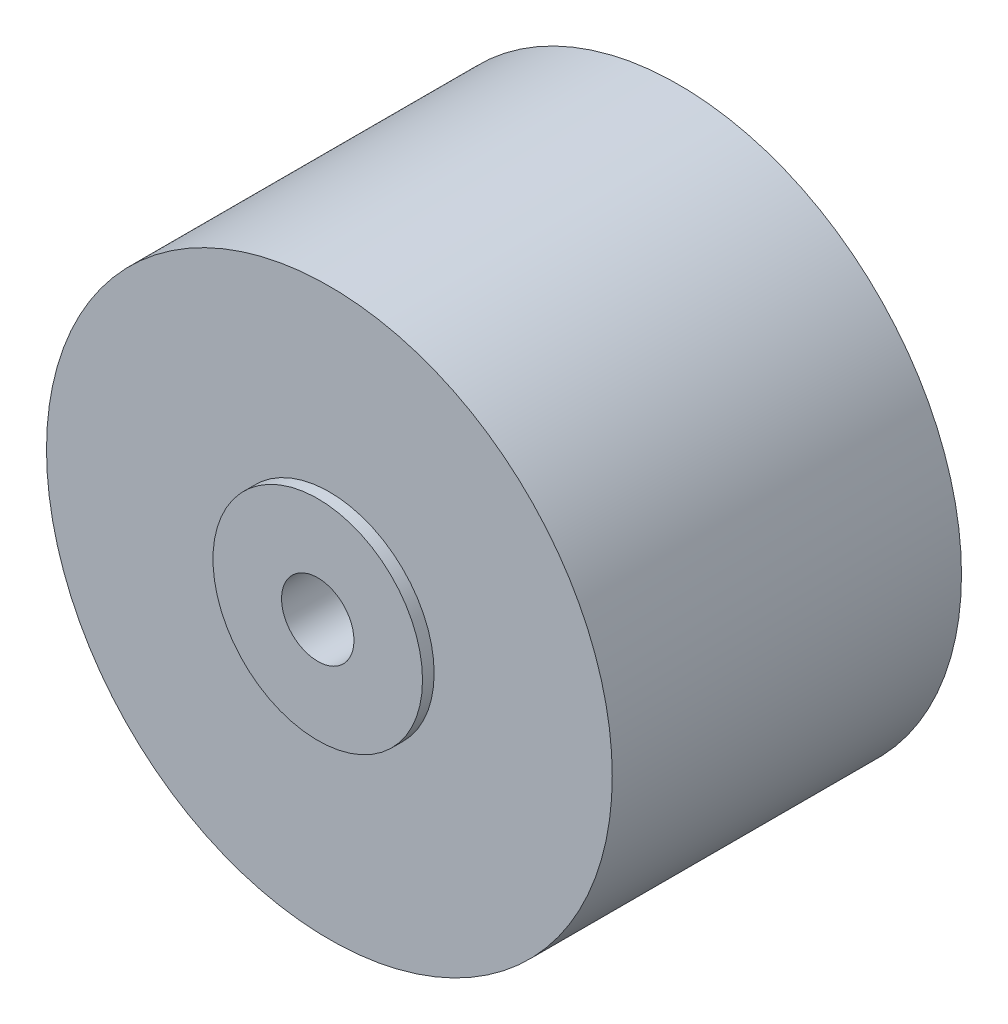
ISO-10303-21;
HEADER;
FILE_DESCRIPTION(('STEP AP214'),'2;1');
FILE_NAME('part.step','',(''),(''),'','','');
FILE_SCHEMA(('AUTOMOTIVE_DESIGN { 1 0 10303 214 1 1 1 1 }'));
ENDSEC;
DATA;
#1=APPLICATION_CONTEXT('core data for automotive mechanical design processes');
#2=APPLICATION_PROTOCOL_DEFINITION('international standard','automotive_design',2000,#1);
#3=PRODUCT_CONTEXT('',#1,'mechanical');
#4=PRODUCT('Part','Part','',(#3));
#5=PRODUCT_RELATED_PRODUCT_CATEGORY('part','',(#4));
#6=PRODUCT_DEFINITION_FORMATION('','',#4);
#7=PRODUCT_DEFINITION_CONTEXT('part definition',#1,'design');
#8=PRODUCT_DEFINITION('design','',#6,#7);
#9=PRODUCT_DEFINITION_SHAPE('','',#8);
#10=(LENGTH_UNIT() NAMED_UNIT(*) SI_UNIT(.MILLI.,.METRE.));
#11=(NAMED_UNIT(*) PLANE_ANGLE_UNIT() SI_UNIT($,.RADIAN.));
#12=(NAMED_UNIT(*) SI_UNIT($,.STERADIAN.) SOLID_ANGLE_UNIT());
#13=UNCERTAINTY_MEASURE_WITH_UNIT(LENGTH_MEASURE(1.E-05),#10,'distance_accuracy_value','');
#14=(GEOMETRIC_REPRESENTATION_CONTEXT(3) GLOBAL_UNCERTAINTY_ASSIGNED_CONTEXT((#13)) GLOBAL_UNIT_ASSIGNED_CONTEXT((#10,
#11,#12)) REPRESENTATION_CONTEXT('',''));
#15=CARTESIAN_POINT('',(0.,0.,0.));
#16=DIRECTION('',(0.,0.,1.));
#17=DIRECTION('',(1.,0.,0.));
#18=AXIS2_PLACEMENT_3D('',#15,#16,#17);
#19=CARTESIAN_POINT('',(0.,0.,0.));
#20=DIRECTION('',(0.,0.,1.));
#21=DIRECTION('',(1.,0.,0.));
#22=AXIS2_PLACEMENT_3D('',#19,#20,#21);
#23=PLANE('',#22);
#24=CARTESIAN_POINT('',(0.,0.,0.));
#25=DIRECTION('',(0.,0.,1.));
#26=DIRECTION('',(1.,0.,0.));
#27=AXIS2_PLACEMENT_3D('',#24,#25,#26);
#28=CIRCLE('',#27,12.15);
#29=CARTESIAN_POINT('',(12.15,0.,0.));
#30=VERTEX_POINT('',#29);
#31=EDGE_CURVE('E39',#30,#30,#28,.T.);
#32=ORIENTED_EDGE('',*,*,#31,.F.);
#33=EDGE_LOOP('',(#32));
#34=FACE_BOUND('',#33,.T.);
#35=CARTESIAN_POINT('',(0.,0.,0.));
#36=DIRECTION('',(0.,0.,1.));
#37=DIRECTION('',(1.,0.,0.));
#38=AXIS2_PLACEMENT_3D('',#35,#36,#37);
#39=CIRCLE('',#38,1.5549846660581);
#40=CARTESIAN_POINT('',(1.5549846660581,0.,0.));
#41=VERTEX_POINT('',#40);
#42=EDGE_CURVE('E51',#41,#41,#39,.F.);
#43=ORIENTED_EDGE('',*,*,#42,.F.);
#44=EDGE_LOOP('',(#43));
#45=FACE_BOUND('',#44,.T.);
#46=ADVANCED_FACE('F31',(#34,#45),#23,.F.);
#47=CARTESIAN_POINT('',(0.,0.,15.5));
#48=DIRECTION('',(0.,0.,1.));
#49=DIRECTION('',(1.,0.,0.));
#50=AXIS2_PLACEMENT_3D('',#47,#48,#49);
#51=PLANE('',#50);
#52=CARTESIAN_POINT('',(0.,0.,15.5));
#53=DIRECTION('',(0.,0.,1.));
#54=DIRECTION('',(1.,0.,0.));
#55=AXIS2_PLACEMENT_3D('',#52,#53,#54);
#56=CIRCLE('',#55,4.5);
#57=CARTESIAN_POINT('',(4.5,0.,15.5));
#58=VERTEX_POINT('',#57);
#59=EDGE_CURVE('E48',#58,#58,#56,.T.);
#60=ORIENTED_EDGE('',*,*,#59,.T.);
#61=EDGE_LOOP('',(#60));
#62=FACE_BOUND('',#61,.T.);
#63=CARTESIAN_POINT('',(0.,0.,15.5));
#64=DIRECTION('',(0.,0.,1.));
#65=DIRECTION('',(1.,0.,0.));
#66=AXIS2_PLACEMENT_3D('',#63,#64,#65);
#67=CIRCLE('',#66,1.5549846660581);
#68=CARTESIAN_POINT('',(1.5549846660581,0.,15.5));
#69=VERTEX_POINT('',#68);
#70=EDGE_CURVE('E35',#69,#69,#67,.F.);
#71=ORIENTED_EDGE('',*,*,#70,.T.);
#72=EDGE_LOOP('',(#71));
#73=FACE_BOUND('',#72,.T.);
#74=ADVANCED_FACE('F58',(#62,#73),#51,.T.);
#75=CARTESIAN_POINT('',(0.,0.,15.));
#76=DIRECTION('',(0.,0.,1.));
#77=DIRECTION('',(1.,0.,0.));
#78=AXIS2_PLACEMENT_3D('',#75,#76,#77);
#79=PLANE('',#78);
#80=CARTESIAN_POINT('',(0.,0.,15.));
#81=DIRECTION('',(0.,0.,1.));
#82=DIRECTION('',(1.,0.,0.));
#83=AXIS2_PLACEMENT_3D('',#80,#81,#82);
#84=CIRCLE('',#83,12.15);
#85=CARTESIAN_POINT('',(12.15,0.,15.));
#86=VERTEX_POINT('',#85);
#87=EDGE_CURVE('E10',#86,#86,#84,.T.);
#88=ORIENTED_EDGE('',*,*,#87,.T.);
#89=EDGE_LOOP('',(#88));
#90=FACE_BOUND('',#89,.T.);
#91=CARTESIAN_POINT('',(0.,0.,15.));
#92=DIRECTION('',(0.,0.,1.));
#93=DIRECTION('',(1.,0.,0.));
#94=AXIS2_PLACEMENT_3D('',#91,#92,#93);
#95=CIRCLE('',#94,4.5);
#96=CARTESIAN_POINT('',(4.5,0.,15.));
#97=VERTEX_POINT('',#96);
#98=EDGE_CURVE('E44',#97,#97,#95,.F.);
#99=ORIENTED_EDGE('',*,*,#98,.T.);
#100=EDGE_LOOP('',(#99));
#101=FACE_BOUND('',#100,.T.);
#102=ADVANCED_FACE('F75',(#90,#101),#79,.T.);
#103=CARTESIAN_POINT('',(0.,0.,15.));
#104=DIRECTION('',(0.,0.,-1.));
#105=DIRECTION('',(-1.,0.,0.));
#106=AXIS2_PLACEMENT_3D('',#103,#104,#105);
#107=CYLINDRICAL_SURFACE('',#106,12.15);
#108=ORIENTED_EDGE('',*,*,#87,.F.);
#109=EDGE_LOOP('',(#108));
#110=FACE_BOUND('',#109,.T.);
#111=ORIENTED_EDGE('',*,*,#31,.T.);
#112=EDGE_LOOP('',(#111));
#113=FACE_BOUND('',#112,.T.);
#114=ADVANCED_FACE('F33',(#110,#113),#107,.T.);
#115=CARTESIAN_POINT('',(0.,0.,15.5));
#116=DIRECTION('',(0.,0.,-1.));
#117=DIRECTION('',(-1.,0.,0.));
#118=AXIS2_PLACEMENT_3D('',#115,#116,#117);
#119=CYLINDRICAL_SURFACE('',#118,4.5);
#120=ORIENTED_EDGE('',*,*,#98,.F.);
#121=EDGE_LOOP('',(#120));
#122=FACE_BOUND('',#121,.T.);
#123=ORIENTED_EDGE('',*,*,#59,.F.);
#124=EDGE_LOOP('',(#123));
#125=FACE_BOUND('',#124,.T.);
#126=ADVANCED_FACE('F62',(#122,#125),#119,.T.);
#127=CARTESIAN_POINT('',(0.,0.,19.5));
#128=DIRECTION('',(0.,0.,-1.));
#129=DIRECTION('',(-1.,0.,0.));
#130=AXIS2_PLACEMENT_3D('',#127,#128,#129);
#131=CYLINDRICAL_SURFACE('',#130,1.5549846660581);
#132=ORIENTED_EDGE('',*,*,#70,.F.);
#133=EDGE_LOOP('',(#132));
#134=FACE_BOUND('',#133,.T.);
#135=ORIENTED_EDGE('',*,*,#42,.T.);
#136=EDGE_LOOP('',(#135));
#137=FACE_BOUND('',#136,.T.);
#138=ADVANCED_FACE('F60',(#134,#137),#131,.F.);
#139=CLOSED_SHELL('',(#46,#74,#102,#114,#126,#138));
#140=MANIFOLD_SOLID_BREP('B2',#139);
#141=ADVANCED_BREP_SHAPE_REPRESENTATION('',(#18,#140),#14);
#142=SHAPE_DEFINITION_REPRESENTATION(#9,#141);
ENDSEC;
END-ISO-10303-21;
